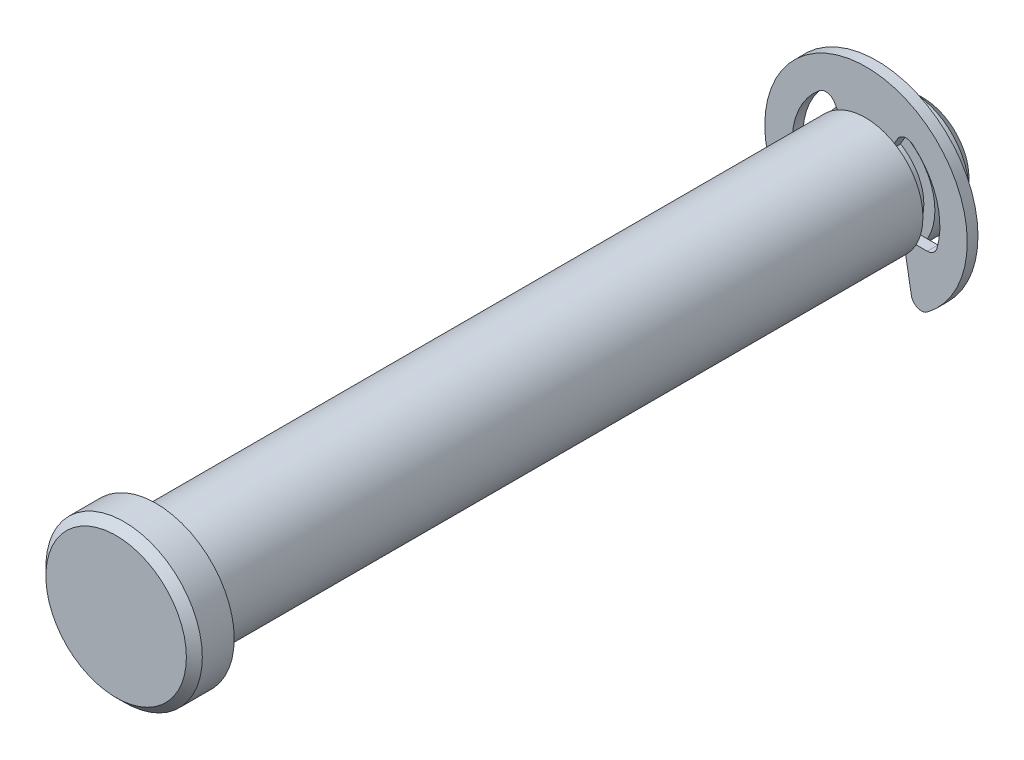
ISO-10303-21;
HEADER;
FILE_DESCRIPTION(('STEP AP214'),'2;1');
FILE_NAME('part.step','',(''),(''),'','','');
FILE_SCHEMA(('AUTOMOTIVE_DESIGN { 1 0 10303 214 1 1 1 1 }'));
ENDSEC;
DATA;
#1=APPLICATION_CONTEXT('core data for automotive mechanical design processes');
#2=APPLICATION_PROTOCOL_DEFINITION('international standard','automotive_design',2000,#1);
#3=PRODUCT_CONTEXT('',#1,'mechanical');
#4=PRODUCT('Part','Part','',(#3));
#5=PRODUCT_RELATED_PRODUCT_CATEGORY('part','',(#4));
#6=PRODUCT_DEFINITION_FORMATION('','',#4);
#7=PRODUCT_DEFINITION_CONTEXT('part definition',#1,'design');
#8=PRODUCT_DEFINITION('design','',#6,#7);
#9=PRODUCT_DEFINITION_SHAPE('','',#8);
#10=(LENGTH_UNIT() NAMED_UNIT(*) SI_UNIT(.MILLI.,.METRE.));
#11=(NAMED_UNIT(*) PLANE_ANGLE_UNIT() SI_UNIT($,.RADIAN.));
#12=(NAMED_UNIT(*) SI_UNIT($,.STERADIAN.) SOLID_ANGLE_UNIT());
#13=UNCERTAINTY_MEASURE_WITH_UNIT(LENGTH_MEASURE(1.E-05),#10,'distance_accuracy_value','');
#14=(GEOMETRIC_REPRESENTATION_CONTEXT(3) GLOBAL_UNCERTAINTY_ASSIGNED_CONTEXT((#13)) GLOBAL_UNIT_ASSIGNED_CONTEXT((#10,
#11,#12)) REPRESENTATION_CONTEXT('',''));
#15=CARTESIAN_POINT('',(0.,0.,0.));
#16=DIRECTION('',(0.,0.,1.));
#17=DIRECTION('',(1.,0.,0.));
#18=AXIS2_PLACEMENT_3D('',#15,#16,#17);
#19=CARTESIAN_POINT('',(0.,0.,-27.0383));
#20=DIRECTION('',(0.,0.,1.));
#21=DIRECTION('',(1.,0.,0.));
#22=AXIS2_PLACEMENT_3D('',#19,#20,#21);
#23=PLANE('',#22);
#24=DIRECTION('',(-0.173648177666931,0.984807753012208,0.));
#25=VECTOR('',#24,1.);
#26=CARTESIAN_POINT('',(2.59081415555905,0.45683043762648,-27.0383));
#27=LINE('',#26,#25);
#28=CARTESIAN_POINT('',(3.7540636467653,-6.14028525353106,-27.0383));
#29=VERTEX_POINT('',#28);
#30=CARTESIAN_POINT('',(3.07848,-2.30886,-27.0383));
#31=VERTEX_POINT('',#30);
#32=EDGE_CURVE('E250',#29,#31,#27,.T.);
#33=ORIENTED_EDGE('',*,*,#32,.F.);
#34=CARTESIAN_POINT('',(4.57952950534013,-5.99473335101063,-27.0383));
#35=DIRECTION('',(0.,0.,1.));
#36=DIRECTION('',(1.,0.,0.));
#37=AXIS2_PLACEMENT_3D('',#34,#35,#36);
#38=CIRCLE('',#37,0.8382);
#39=CARTESIAN_POINT('',(5.08836611704459,-6.66081483445626,-27.0383));
#40=VERTEX_POINT('',#39);
#41=EDGE_CURVE('E324',#29,#40,#38,.T.);
#42=ORIENTED_EDGE('',*,*,#41,.T.);
#43=CARTESIAN_POINT('',(0.,0.,-27.0383));
#44=DIRECTION('',(0.,0.,1.));
#45=DIRECTION('',(1.,0.,0.));
#46=AXIS2_PLACEMENT_3D('',#43,#44,#45);
#47=CIRCLE('',#46,8.382);
#48=CARTESIAN_POINT('',(-5.08836611704459,-6.66081483445626,-27.0383));
#49=VERTEX_POINT('',#48);
#50=EDGE_CURVE('E221',#40,#49,#47,.T.);
#51=ORIENTED_EDGE('',*,*,#50,.T.);
#52=CARTESIAN_POINT('',(-4.57952950534013,-5.99473335101063,-27.0383));
#53=DIRECTION('',(0.,0.,1.));
#54=DIRECTION('',(1.,0.,0.));
#55=AXIS2_PLACEMENT_3D('',#52,#53,#54);
#56=CIRCLE('',#55,0.8382);
#57=CARTESIAN_POINT('',(-3.7540636467653,-6.14028525353106,-27.0383));
#58=VERTEX_POINT('',#57);
#59=EDGE_CURVE('E321',#49,#58,#56,.T.);
#60=ORIENTED_EDGE('',*,*,#59,.T.);
#61=DIRECTION('',(-0.173648177666931,-0.984807753012208,0.));
#62=VECTOR('',#61,1.);
#63=CARTESIAN_POINT('',(-2.59081415555905,0.45683043762648,-27.0383));
#64=LINE('',#63,#62);
#65=CARTESIAN_POINT('',(-3.07848,-2.30886,-27.0383));
#66=VERTEX_POINT('',#65);
#67=EDGE_CURVE('E244',#66,#58,#64,.T.);
#68=ORIENTED_EDGE('',*,*,#67,.F.);
#69=DIRECTION('',(1.,0.,0.));
#70=VECTOR('',#69,1.);
#71=CARTESIAN_POINT('',(0.,-2.30886,-27.0383));
#72=LINE('',#71,#70);
#73=CARTESIAN_POINT('',(-5.06777121493266,-2.30886,-27.0383));
#74=VERTEX_POINT('',#73);
#75=EDGE_CURVE('E232',#74,#66,#72,.T.);
#76=ORIENTED_EDGE('',*,*,#75,.F.);
#77=CARTESIAN_POINT('',(-5.06777121493266,-1.47066,-27.0383));
#78=DIRECTION('',(0.,0.,1.));
#79=DIRECTION('',(1.,0.,0.));
#80=AXIS2_PLACEMENT_3D('',#77,#78,#79);
#81=CIRCLE('',#80,0.8382);
#82=CARTESIAN_POINT('',(-5.87276014438044,-1.70426664259928,-27.0383));
#83=VERTEX_POINT('',#82);
#84=EDGE_CURVE('E59',#74,#83,#81,.F.);
#85=ORIENTED_EDGE('',*,*,#84,.T.);
#86=CARTESIAN_POINT('',(0.,0.,-27.0383));
#87=DIRECTION('',(0.,0.,1.));
#88=DIRECTION('',(1.,0.,0.));
#89=AXIS2_PLACEMENT_3D('',#86,#87,#88);
#90=CIRCLE('',#89,6.11505);
#91=CARTESIAN_POINT('',(-3.85991365439078,4.74287919761273,-27.0383));
#92=VERTEX_POINT('',#91);
#93=EDGE_CURVE('E267',#92,#83,#90,.T.);
#94=ORIENTED_EDGE('',*,*,#93,.F.);
#95=CARTESIAN_POINT('',(-3.33082891671728,4.09276491507392,-27.0383));
#96=DIRECTION('',(0.,0.,1.));
#97=DIRECTION('',(1.,0.,0.));
#98=AXIS2_PLACEMENT_3D('',#95,#96,#97);
#99=CIRCLE('',#98,0.8382);
#100=CARTESIAN_POINT('',(-2.60492642326516,4.51186491507392,-27.0383));
#101=VERTEX_POINT('',#100);
#102=EDGE_CURVE('E225',#92,#101,#99,.F.);
#103=ORIENTED_EDGE('',*,*,#102,.T.);
#104=DIRECTION('',(-0.500000000000001,0.866025403784438,0.));
#105=VECTOR('',#104,1.);
#106=CARTESIAN_POINT('',(0.,0.,-27.0383));
#107=LINE('',#106,#105);
#108=CARTESIAN_POINT('',(-1.92405000000001,3.33255235630289,-27.0383));
#109=VERTEX_POINT('',#108);
#110=EDGE_CURVE('E216',#109,#101,#107,.T.);
#111=ORIENTED_EDGE('',*,*,#110,.F.);
#112=DIRECTION('',(1.,0.,0.));
#113=VECTOR('',#112,1.);
#114=CARTESIAN_POINT('',(-1.92405000000001,3.33255235630289,-27.0383));
#115=LINE('',#114,#113);
#116=CARTESIAN_POINT('',(1.92405000000001,3.33255235630289,-27.0383));
#117=VERTEX_POINT('',#116);
#118=EDGE_CURVE('E199',#109,#117,#115,.T.);
#119=ORIENTED_EDGE('',*,*,#118,.T.);
#120=DIRECTION('',(-0.500000000000001,-0.866025403784438,0.));
#121=VECTOR('',#120,1.);
#122=CARTESIAN_POINT('',(0.,0.,-27.0383));
#123=LINE('',#122,#121);
#124=CARTESIAN_POINT('',(2.60492642326516,4.51186491507392,-27.0383));
#125=VERTEX_POINT('',#124);
#126=EDGE_CURVE('E264',#125,#117,#123,.T.);
#127=ORIENTED_EDGE('',*,*,#126,.F.);
#128=CARTESIAN_POINT('',(3.33082891671728,4.09276491507392,-27.0383));
#129=DIRECTION('',(0.,0.,1.));
#130=DIRECTION('',(1.,0.,0.));
#131=AXIS2_PLACEMENT_3D('',#128,#129,#130);
#132=CIRCLE('',#131,0.8382);
#133=CARTESIAN_POINT('',(3.85991365439078,4.74287919761273,-27.0383));
#134=VERTEX_POINT('',#133);
#135=EDGE_CURVE('E347',#125,#134,#132,.F.);
#136=ORIENTED_EDGE('',*,*,#135,.T.);
#137=CARTESIAN_POINT('',(0.,0.,-27.0383));
#138=DIRECTION('',(0.,0.,1.));
#139=DIRECTION('',(1.,0.,0.));
#140=AXIS2_PLACEMENT_3D('',#137,#138,#139);
#141=CIRCLE('',#140,6.11505);
#142=CARTESIAN_POINT('',(5.87276014438044,-1.70426664259928,-27.0383));
#143=VERTEX_POINT('',#142);
#144=EDGE_CURVE('E271',#143,#134,#141,.T.);
#145=ORIENTED_EDGE('',*,*,#144,.F.);
#146=CARTESIAN_POINT('',(5.06777121493266,-1.47066,-27.0383));
#147=DIRECTION('',(0.,0.,1.));
#148=DIRECTION('',(1.,0.,0.));
#149=AXIS2_PLACEMENT_3D('',#146,#147,#148);
#150=CIRCLE('',#149,0.8382);
#151=CARTESIAN_POINT('',(5.06777121493266,-2.30886,-27.0383));
#152=VERTEX_POINT('',#151);
#153=EDGE_CURVE('E341',#143,#152,#150,.F.);
#154=ORIENTED_EDGE('',*,*,#153,.T.);
#155=DIRECTION('',(1.,0.,0.));
#156=VECTOR('',#155,1.);
#157=CARTESIAN_POINT('',(0.,-2.30886,-27.0383));
#158=LINE('',#157,#156);
#159=EDGE_CURVE('E257',#31,#152,#158,.T.);
#160=ORIENTED_EDGE('',*,*,#159,.F.);
#161=EDGE_LOOP('',(#33,#42,#51,#60,#68,#76,#85,#94,#103,#111,#119,#127,#136,#145,#154,#160));
#162=FACE_BOUND('',#161,.T.);
#163=ADVANCED_FACE('F50',(#162),#23,.T.);
#164=CARTESIAN_POINT('',(0.,0.,-27.9273));
#165=DIRECTION('',(0.,0.,1.));
#166=DIRECTION('',(1.,0.,0.));
#167=AXIS2_PLACEMENT_3D('',#164,#165,#166);
#168=PLANE('',#167);
#169=CARTESIAN_POINT('',(0.,0.,-27.9273));
#170=DIRECTION('',(0.,0.,1.));
#171=DIRECTION('',(1.,0.,0.));
#172=AXIS2_PLACEMENT_3D('',#169,#170,#171);
#173=CIRCLE('',#172,8.382);
#174=CARTESIAN_POINT('',(5.08836611704459,-6.66081483445626,-27.9273));
#175=VERTEX_POINT('',#174);
#176=CARTESIAN_POINT('',(-5.08836611704459,-6.66081483445626,-27.9273));
#177=VERTEX_POINT('',#176);
#178=EDGE_CURVE('E275',#175,#177,#173,.T.);
#179=ORIENTED_EDGE('',*,*,#178,.F.);
#180=CARTESIAN_POINT('',(4.57952950534013,-5.99473335101063,-27.9273));
#181=DIRECTION('',(0.,0.,1.));
#182=DIRECTION('',(1.,0.,0.));
#183=AXIS2_PLACEMENT_3D('',#180,#181,#182);
#184=CIRCLE('',#183,0.8382);
#185=CARTESIAN_POINT('',(3.7540636467653,-6.14028525353106,-27.9273));
#186=VERTEX_POINT('',#185);
#187=EDGE_CURVE('E336',#175,#186,#184,.F.);
#188=ORIENTED_EDGE('',*,*,#187,.T.);
#189=DIRECTION('',(-0.173648177666931,0.984807753012208,0.));
#190=VECTOR('',#189,1.);
#191=CARTESIAN_POINT('',(2.59081415555905,0.45683043762648,-27.9273));
#192=LINE('',#191,#190);
#193=CARTESIAN_POINT('',(3.07848,-2.30886,-27.9273));
#194=VERTEX_POINT('',#193);
#195=EDGE_CURVE('E247',#186,#194,#192,.T.);
#196=ORIENTED_EDGE('',*,*,#195,.T.);
#197=DIRECTION('',(1.,0.,0.));
#198=VECTOR('',#197,1.);
#199=CARTESIAN_POINT('',(0.,-2.30886,-27.9273));
#200=LINE('',#199,#198);
#201=CARTESIAN_POINT('',(5.06777121493266,-2.30886,-27.9273));
#202=VERTEX_POINT('',#201);
#203=EDGE_CURVE('E253',#194,#202,#200,.T.);
#204=ORIENTED_EDGE('',*,*,#203,.T.);
#205=CARTESIAN_POINT('',(5.06777121493266,-1.47066,-27.9273));
#206=DIRECTION('',(0.,0.,1.));
#207=DIRECTION('',(1.,0.,0.));
#208=AXIS2_PLACEMENT_3D('',#205,#206,#207);
#209=CIRCLE('',#208,0.8382);
#210=CARTESIAN_POINT('',(5.87276014438044,-1.70426664259928,-27.9273));
#211=VERTEX_POINT('',#210);
#212=EDGE_CURVE('E344',#202,#211,#209,.T.);
#213=ORIENTED_EDGE('',*,*,#212,.T.);
#214=CARTESIAN_POINT('',(0.,0.,-27.9273));
#215=DIRECTION('',(0.,0.,1.));
#216=DIRECTION('',(1.,0.,0.));
#217=AXIS2_PLACEMENT_3D('',#214,#215,#216);
#218=CIRCLE('',#217,6.11505);
#219=CARTESIAN_POINT('',(3.85991365439078,4.74287919761273,-27.9273));
#220=VERTEX_POINT('',#219);
#221=EDGE_CURVE('E287',#211,#220,#218,.T.);
#222=ORIENTED_EDGE('',*,*,#221,.T.);
#223=CARTESIAN_POINT('',(3.33082891671728,4.09276491507392,-27.9273));
#224=DIRECTION('',(0.,0.,1.));
#225=DIRECTION('',(1.,0.,0.));
#226=AXIS2_PLACEMENT_3D('',#223,#224,#225);
#227=CIRCLE('',#226,0.8382);
#228=CARTESIAN_POINT('',(2.60492642326516,4.51186491507392,-27.9273));
#229=VERTEX_POINT('',#228);
#230=EDGE_CURVE('E350',#220,#229,#227,.T.);
#231=ORIENTED_EDGE('',*,*,#230,.T.);
#232=DIRECTION('',(-0.500000000000001,-0.866025403784438,0.));
#233=VECTOR('',#232,1.);
#234=CARTESIAN_POINT('',(0.,0.,-27.9273));
#235=LINE('',#234,#233);
#236=CARTESIAN_POINT('',(1.92405000000001,3.3325523563029,-27.9273));
#237=VERTEX_POINT('',#236);
#238=EDGE_CURVE('E261',#229,#237,#235,.T.);
#239=ORIENTED_EDGE('',*,*,#238,.T.);
#240=DIRECTION('',(-1.,0.,0.));
#241=VECTOR('',#240,1.);
#242=CARTESIAN_POINT('',(-1.92405000000001,3.33255235630289,-27.9273));
#243=LINE('',#242,#241);
#244=CARTESIAN_POINT('',(-1.92405000000001,3.33255235630289,-27.9273));
#245=VERTEX_POINT('',#244);
#246=EDGE_CURVE('E211',#237,#245,#243,.T.);
#247=ORIENTED_EDGE('',*,*,#246,.T.);
#248=DIRECTION('',(-0.500000000000001,0.866025403784438,0.));
#249=VECTOR('',#248,1.);
#250=CARTESIAN_POINT('',(0.,0.,-27.9273));
#251=LINE('',#250,#249);
#252=CARTESIAN_POINT('',(-2.60492642326516,4.51186491507392,-27.9273));
#253=VERTEX_POINT('',#252);
#254=EDGE_CURVE('E219',#245,#253,#251,.T.);
#255=ORIENTED_EDGE('',*,*,#254,.T.);
#256=CARTESIAN_POINT('',(-3.33082891671728,4.09276491507392,-27.9273));
#257=DIRECTION('',(0.,0.,1.));
#258=DIRECTION('',(1.,0.,0.));
#259=AXIS2_PLACEMENT_3D('',#256,#257,#258);
#260=CIRCLE('',#259,0.8382);
#261=CARTESIAN_POINT('',(-3.85991365439078,4.74287919761273,-27.9273));
#262=VERTEX_POINT('',#261);
#263=EDGE_CURVE('E355',#253,#262,#260,.T.);
#264=ORIENTED_EDGE('',*,*,#263,.T.);
#265=CARTESIAN_POINT('',(0.,0.,-27.9273));
#266=DIRECTION('',(0.,0.,1.));
#267=DIRECTION('',(1.,0.,0.));
#268=AXIS2_PLACEMENT_3D('',#265,#266,#267);
#269=CIRCLE('',#268,6.11505);
#270=CARTESIAN_POINT('',(-5.87276014438044,-1.70426664259928,-27.9273));
#271=VERTEX_POINT('',#270);
#272=EDGE_CURVE('E283',#262,#271,#269,.T.);
#273=ORIENTED_EDGE('',*,*,#272,.T.);
#274=CARTESIAN_POINT('',(-5.06777121493266,-1.47066,-27.9273));
#275=DIRECTION('',(0.,0.,1.));
#276=DIRECTION('',(1.,0.,0.));
#277=AXIS2_PLACEMENT_3D('',#274,#275,#276);
#278=CIRCLE('',#277,0.8382);
#279=CARTESIAN_POINT('',(-5.06777121493266,-2.30886,-27.9273));
#280=VERTEX_POINT('',#279);
#281=EDGE_CURVE('E12',#271,#280,#278,.T.);
#282=ORIENTED_EDGE('',*,*,#281,.T.);
#283=DIRECTION('',(1.,0.,0.));
#284=VECTOR('',#283,1.);
#285=CARTESIAN_POINT('',(0.,-2.30886,-27.9273));
#286=LINE('',#285,#284);
#287=CARTESIAN_POINT('',(-3.07848,-2.30886,-27.9273));
#288=VERTEX_POINT('',#287);
#289=EDGE_CURVE('E227',#280,#288,#286,.T.);
#290=ORIENTED_EDGE('',*,*,#289,.T.);
#291=DIRECTION('',(-0.173648177666931,-0.984807753012208,0.));
#292=VECTOR('',#291,1.);
#293=CARTESIAN_POINT('',(-2.59081415555905,0.45683043762648,-27.9273));
#294=LINE('',#293,#292);
#295=CARTESIAN_POINT('',(-3.7540636467653,-6.14028525353106,-27.9273));
#296=VERTEX_POINT('',#295);
#297=EDGE_CURVE('E241',#288,#296,#294,.T.);
#298=ORIENTED_EDGE('',*,*,#297,.T.);
#299=CARTESIAN_POINT('',(-4.57952950534013,-5.99473335101063,-27.9273));
#300=DIRECTION('',(0.,0.,1.));
#301=DIRECTION('',(1.,0.,0.));
#302=AXIS2_PLACEMENT_3D('',#299,#300,#301);
#303=CIRCLE('',#302,0.8382);
#304=EDGE_CURVE('E78',#296,#177,#303,.F.);
#305=ORIENTED_EDGE('',*,*,#304,.T.);
#306=EDGE_LOOP('',(#179,#188,#196,#204,#213,#222,#231,#239,#247,#255,#264,#273,#282,#290,#298,#305));
#307=FACE_BOUND('',#306,.T.);
#308=ADVANCED_FACE('F370',(#307),#168,.F.);
#309=CARTESIAN_POINT('',(0.,0.,-27.0383));
#310=DIRECTION('',(0.,0.,-1.));
#311=DIRECTION('',(-1.,0.,0.));
#312=AXIS2_PLACEMENT_3D('',#309,#310,#311);
#313=CYLINDRICAL_SURFACE('',#312,8.382);
#314=ORIENTED_EDGE('',*,*,#50,.F.);
#315=DIRECTION('',(0.,0.,-1.));
#316=VECTOR('',#315,1.);
#317=CARTESIAN_POINT('',(5.08836611704459,-6.66081483445626,-27.0383));
#318=LINE('',#317,#316);
#319=EDGE_CURVE('E331',#40,#175,#318,.T.);
#320=ORIENTED_EDGE('',*,*,#319,.T.);
#321=ORIENTED_EDGE('',*,*,#178,.T.);
#322=DIRECTION('',(0.,0.,-1.));
#323=VECTOR('',#322,1.);
#324=CARTESIAN_POINT('',(-5.08836611704459,-6.66081483445626,-27.0383));
#325=LINE('',#324,#323);
#326=EDGE_CURVE('E327',#177,#49,#325,.F.);
#327=ORIENTED_EDGE('',*,*,#326,.T.);
#328=EDGE_LOOP('',(#314,#320,#321,#327));
#329=FACE_BOUND('',#328,.T.);
#330=ADVANCED_FACE('F413',(#329),#313,.T.);
#331=CARTESIAN_POINT('',(-3.07848,-2.30886,-31.75));
#332=DIRECTION('',(-0.984807753012208,0.173648177666931,0.));
#333=DIRECTION('',(-0.173648177666931,-0.984807753012208,0.));
#334=AXIS2_PLACEMENT_3D('',#331,#332,#333);
#335=PLANE('',#334);
#336=ORIENTED_EDGE('',*,*,#67,.T.);
#337=DIRECTION('',(0.,0.,-1.));
#338=VECTOR('',#337,1.);
#339=CARTESIAN_POINT('',(-3.7540636467653,-6.14028525353106,-31.75));
#340=LINE('',#339,#338);
#341=EDGE_CURVE('E69',#58,#296,#340,.T.);
#342=ORIENTED_EDGE('',*,*,#341,.T.);
#343=ORIENTED_EDGE('',*,*,#297,.F.);
#344=DIRECTION('',(0.,0.,1.));
#345=VECTOR('',#344,1.);
#346=CARTESIAN_POINT('',(-3.07848,-2.30886,-31.75));
#347=LINE('',#346,#345);
#348=EDGE_CURVE('E375',#288,#66,#347,.T.);
#349=ORIENTED_EDGE('',*,*,#348,.T.);
#350=EDGE_LOOP('',(#336,#342,#343,#349));
#351=FACE_BOUND('',#350,.T.);
#352=ADVANCED_FACE('F418',(#351),#335,.F.);
#353=CARTESIAN_POINT('',(-3.05752500000001,5.29578864541203,-31.75));
#354=DIRECTION('',(0.866025403784438,0.500000000000001,0.));
#355=DIRECTION('',(-0.500000000000001,0.866025403784438,0.));
#356=AXIS2_PLACEMENT_3D('',#353,#354,#355);
#357=PLANE('',#356);
#358=ORIENTED_EDGE('',*,*,#110,.T.);
#359=DIRECTION('',(0.,0.,-1.));
#360=VECTOR('',#359,1.);
#361=CARTESIAN_POINT('',(-2.60492642326516,4.51186491507392,-27.9273));
#362=LINE('',#361,#360);
#363=EDGE_CURVE('E310',#101,#253,#362,.T.);
#364=ORIENTED_EDGE('',*,*,#363,.T.);
#365=ORIENTED_EDGE('',*,*,#254,.F.);
#366=DIRECTION('',(0.,0.,-1.));
#367=VECTOR('',#366,1.);
#368=CARTESIAN_POINT('',(-1.92405000000001,3.3325523563029,-27.0383));
#369=LINE('',#368,#367);
#370=EDGE_CURVE('E203',#245,#109,#369,.F.);
#371=ORIENTED_EDGE('',*,*,#370,.T.);
#372=EDGE_LOOP('',(#358,#364,#365,#371));
#373=FACE_BOUND('',#372,.T.);
#374=ADVANCED_FACE('F215',(#373),#357,.F.);
#375=CARTESIAN_POINT('',(0.,0.,-31.75));
#376=DIRECTION('',(0.,0.,1.));
#377=DIRECTION('',(1.,0.,0.));
#378=AXIS2_PLACEMENT_3D('',#375,#376,#377);
#379=CYLINDRICAL_SURFACE('',#378,6.11505);
#380=ORIENTED_EDGE('',*,*,#272,.F.);
#381=DIRECTION('',(0.,0.,1.));
#382=VECTOR('',#381,1.);
#383=CARTESIAN_POINT('',(-3.85991365439078,4.74287919761273,-31.75));
#384=LINE('',#383,#382);
#385=EDGE_CURVE('E306',#262,#92,#384,.T.);
#386=ORIENTED_EDGE('',*,*,#385,.T.);
#387=ORIENTED_EDGE('',*,*,#93,.T.);
#388=DIRECTION('',(0.,0.,1.));
#389=VECTOR('',#388,1.);
#390=CARTESIAN_POINT('',(-5.87276014438044,-1.70426664259928,-31.75));
#391=LINE('',#390,#389);
#392=EDGE_CURVE('E303',#83,#271,#391,.F.);
#393=ORIENTED_EDGE('',*,*,#392,.T.);
#394=EDGE_LOOP('',(#380,#386,#387,#393));
#395=FACE_BOUND('',#394,.T.);
#396=ADVANCED_FACE('F365',(#395),#379,.F.);
#397=CARTESIAN_POINT('',(-5.66242015421851,-2.30886,-31.75));
#398=DIRECTION('',(0.,-1.,0.));
#399=DIRECTION('',(0.,0.,-1.));
#400=AXIS2_PLACEMENT_3D('',#397,#398,#399);
#401=PLANE('',#400);
#402=ORIENTED_EDGE('',*,*,#289,.F.);
#403=DIRECTION('',(0.,0.,-1.));
#404=VECTOR('',#403,1.);
#405=CARTESIAN_POINT('',(-5.06777121493266,-2.30886,-27.0383));
#406=LINE('',#405,#404);
#407=EDGE_CURVE('E313',#280,#74,#406,.F.);
#408=ORIENTED_EDGE('',*,*,#407,.T.);
#409=ORIENTED_EDGE('',*,*,#75,.T.);
#410=ORIENTED_EDGE('',*,*,#348,.F.);
#411=EDGE_LOOP('',(#402,#408,#409,#410));
#412=FACE_BOUND('',#411,.T.);
#413=ADVANCED_FACE('F373',(#412),#401,.F.);
#414=CARTESIAN_POINT('',(0.,0.,-31.75));
#415=DIRECTION('',(0.,0.,1.));
#416=DIRECTION('',(1.,0.,0.));
#417=AXIS2_PLACEMENT_3D('',#414,#415,#416);
#418=CYLINDRICAL_SURFACE('',#417,6.11505);
#419=ORIENTED_EDGE('',*,*,#221,.F.);
#420=DIRECTION('',(0.,0.,1.));
#421=VECTOR('',#420,1.);
#422=CARTESIAN_POINT('',(5.87276014438044,-1.70426664259928,-31.75));
#423=LINE('',#422,#421);
#424=EDGE_CURVE('E294',#211,#143,#423,.T.);
#425=ORIENTED_EDGE('',*,*,#424,.T.);
#426=ORIENTED_EDGE('',*,*,#144,.T.);
#427=DIRECTION('',(0.,0.,1.));
#428=VECTOR('',#427,1.);
#429=CARTESIAN_POINT('',(3.85991365439078,4.74287919761273,-31.75));
#430=LINE('',#429,#428);
#431=EDGE_CURVE('E291',#134,#220,#430,.F.);
#432=ORIENTED_EDGE('',*,*,#431,.T.);
#433=EDGE_LOOP('',(#419,#425,#426,#432));
#434=FACE_BOUND('',#433,.T.);
#435=ADVANCED_FACE('F392',(#434),#418,.F.);
#436=CARTESIAN_POINT('',(3.07848,-2.30886,-31.75));
#437=DIRECTION('',(0.,-1.,0.));
#438=DIRECTION('',(0.,0.,-1.));
#439=AXIS2_PLACEMENT_3D('',#436,#437,#438);
#440=PLANE('',#439);
#441=ORIENTED_EDGE('',*,*,#159,.T.);
#442=DIRECTION('',(0.,0.,-1.));
#443=VECTOR('',#442,1.);
#444=CARTESIAN_POINT('',(5.06777121493266,-2.30886,-27.9273));
#445=LINE('',#444,#443);
#446=EDGE_CURVE('E297',#152,#202,#445,.T.);
#447=ORIENTED_EDGE('',*,*,#446,.T.);
#448=ORIENTED_EDGE('',*,*,#203,.F.);
#449=DIRECTION('',(0.,0.,1.));
#450=VECTOR('',#449,1.);
#451=CARTESIAN_POINT('',(3.07848,-2.30886,-31.75));
#452=LINE('',#451,#450);
#453=EDGE_CURVE('E235',#194,#31,#452,.T.);
#454=ORIENTED_EDGE('',*,*,#453,.T.);
#455=EDGE_LOOP('',(#441,#447,#448,#454));
#456=FACE_BOUND('',#455,.T.);
#457=ADVANCED_FACE('F402',(#456),#440,.F.);
#458=CARTESIAN_POINT('',(3.07848,-2.30886,-31.75));
#459=DIRECTION('',(0.984807753012208,0.173648177666931,0.));
#460=DIRECTION('',(-0.173648177666931,0.984807753012208,0.));
#461=AXIS2_PLACEMENT_3D('',#458,#459,#460);
#462=PLANE('',#461);
#463=ORIENTED_EDGE('',*,*,#195,.F.);
#464=DIRECTION('',(0.,0.,-1.));
#465=VECTOR('',#464,1.);
#466=CARTESIAN_POINT('',(3.7540636467653,-6.14028525353106,-31.75));
#467=LINE('',#466,#465);
#468=EDGE_CURVE('E317',#186,#29,#467,.F.);
#469=ORIENTED_EDGE('',*,*,#468,.T.);
#470=ORIENTED_EDGE('',*,*,#32,.T.);
#471=ORIENTED_EDGE('',*,*,#453,.F.);
#472=EDGE_LOOP('',(#463,#469,#470,#471));
#473=FACE_BOUND('',#472,.T.);
#474=ADVANCED_FACE('F407',(#473),#462,.F.);
#475=CARTESIAN_POINT('',(0.,0.,-31.75));
#476=DIRECTION('',(-0.866025403784438,0.500000000000001,0.));
#477=DIRECTION('',(-0.500000000000001,-0.866025403784438,0.));
#478=AXIS2_PLACEMENT_3D('',#475,#476,#477);
#479=PLANE('',#478);
#480=ORIENTED_EDGE('',*,*,#238,.F.);
#481=DIRECTION('',(0.,0.,-1.));
#482=VECTOR('',#481,1.);
#483=CARTESIAN_POINT('',(2.60492642326516,4.51186491507392,-27.0383));
#484=LINE('',#483,#482);
#485=EDGE_CURVE('E299',#229,#125,#484,.F.);
#486=ORIENTED_EDGE('',*,*,#485,.T.);
#487=ORIENTED_EDGE('',*,*,#126,.T.);
#488=DIRECTION('',(0.,0.,-1.));
#489=VECTOR('',#488,1.);
#490=CARTESIAN_POINT('',(1.92405000000001,3.3325523563029,-27.0383));
#491=LINE('',#490,#489);
#492=EDGE_CURVE('E206',#117,#237,#491,.T.);
#493=ORIENTED_EDGE('',*,*,#492,.T.);
#494=EDGE_LOOP('',(#480,#486,#487,#493));
#495=FACE_BOUND('',#494,.T.);
#496=ADVANCED_FACE('F385',(#495),#479,.F.);
#497=CARTESIAN_POINT('',(-1.92405000000001,3.33255235630289,-31.8097815495919));
#498=DIRECTION('',(0.,-1.,0.));
#499=DIRECTION('',(0.,0.,-1.));
#500=AXIS2_PLACEMENT_3D('',#497,#498,#499);
#501=PLANE('',#500);
#502=ORIENTED_EDGE('',*,*,#246,.F.);
#503=ORIENTED_EDGE('',*,*,#492,.F.);
#504=ORIENTED_EDGE('',*,*,#118,.F.);
#505=ORIENTED_EDGE('',*,*,#370,.F.);
#506=EDGE_LOOP('',(#502,#503,#504,#505));
#507=FACE_BOUND('',#506,.T.);
#508=ADVANCED_FACE('F202',(#507),#501,.T.);
#509=CARTESIAN_POINT('',(5.06777121493266,-1.47066,-31.75));
#510=DIRECTION('',(0.,0.,1.));
#511=DIRECTION('',(1.,0.,0.));
#512=AXIS2_PLACEMENT_3D('',#509,#510,#511);
#513=CYLINDRICAL_SURFACE('',#512,0.8382);
#514=ORIENTED_EDGE('',*,*,#212,.F.);
#515=ORIENTED_EDGE('',*,*,#446,.F.);
#516=ORIENTED_EDGE('',*,*,#153,.F.);
#517=ORIENTED_EDGE('',*,*,#424,.F.);
#518=EDGE_LOOP('',(#514,#515,#516,#517));
#519=FACE_BOUND('',#518,.T.);
#520=ADVANCED_FACE('F398',(#519),#513,.F.);
#521=CARTESIAN_POINT('',(3.33082891671728,4.09276491507392,-31.75));
#522=DIRECTION('',(0.,0.,1.));
#523=DIRECTION('',(1.,0.,0.));
#524=AXIS2_PLACEMENT_3D('',#521,#522,#523);
#525=CYLINDRICAL_SURFACE('',#524,0.8382);
#526=ORIENTED_EDGE('',*,*,#230,.F.);
#527=ORIENTED_EDGE('',*,*,#431,.F.);
#528=ORIENTED_EDGE('',*,*,#135,.F.);
#529=ORIENTED_EDGE('',*,*,#485,.F.);
#530=EDGE_LOOP('',(#526,#527,#528,#529));
#531=FACE_BOUND('',#530,.T.);
#532=ADVANCED_FACE('F395',(#531),#525,.F.);
#533=CARTESIAN_POINT('',(-3.33082891671728,4.09276491507392,-31.75));
#534=DIRECTION('',(0.,0.,1.));
#535=DIRECTION('',(1.,0.,0.));
#536=AXIS2_PLACEMENT_3D('',#533,#534,#535);
#537=CYLINDRICAL_SURFACE('',#536,0.8382);
#538=ORIENTED_EDGE('',*,*,#263,.F.);
#539=ORIENTED_EDGE('',*,*,#363,.F.);
#540=ORIENTED_EDGE('',*,*,#102,.F.);
#541=ORIENTED_EDGE('',*,*,#385,.F.);
#542=EDGE_LOOP('',(#538,#539,#540,#541));
#543=FACE_BOUND('',#542,.T.);
#544=ADVANCED_FACE('F441',(#543),#537,.F.);
#545=CARTESIAN_POINT('',(-5.06777121493266,-1.47066,-31.75));
#546=DIRECTION('',(0.,0.,1.));
#547=DIRECTION('',(1.,0.,0.));
#548=AXIS2_PLACEMENT_3D('',#545,#546,#547);
#549=CYLINDRICAL_SURFACE('',#548,0.8382);
#550=ORIENTED_EDGE('',*,*,#281,.F.);
#551=ORIENTED_EDGE('',*,*,#392,.F.);
#552=ORIENTED_EDGE('',*,*,#84,.F.);
#553=ORIENTED_EDGE('',*,*,#407,.F.);
#554=EDGE_LOOP('',(#550,#551,#552,#553));
#555=FACE_BOUND('',#554,.T.);
#556=ADVANCED_FACE('F368',(#555),#549,.F.);
#557=CARTESIAN_POINT('',(4.57952950534013,-5.99473335101063,-27.0383));
#558=DIRECTION('',(0.,0.,-1.));
#559=DIRECTION('',(-1.,0.,0.));
#560=AXIS2_PLACEMENT_3D('',#557,#558,#559);
#561=CYLINDRICAL_SURFACE('',#560,0.8382);
#562=ORIENTED_EDGE('',*,*,#187,.F.);
#563=ORIENTED_EDGE('',*,*,#319,.F.);
#564=ORIENTED_EDGE('',*,*,#41,.F.);
#565=ORIENTED_EDGE('',*,*,#468,.F.);
#566=EDGE_LOOP('',(#562,#563,#564,#565));
#567=FACE_BOUND('',#566,.T.);
#568=ADVANCED_FACE('F416',(#567),#561,.T.);
#569=CARTESIAN_POINT('',(-4.57952950534013,-5.99473335101063,-27.0383));
#570=DIRECTION('',(0.,0.,-1.));
#571=DIRECTION('',(-1.,0.,0.));
#572=AXIS2_PLACEMENT_3D('',#569,#570,#571);
#573=CYLINDRICAL_SURFACE('',#572,0.8382);
#574=ORIENTED_EDGE('',*,*,#304,.F.);
#575=ORIENTED_EDGE('',*,*,#341,.F.);
#576=ORIENTED_EDGE('',*,*,#59,.F.);
#577=ORIENTED_EDGE('',*,*,#326,.F.);
#578=EDGE_LOOP('',(#574,#575,#576,#577));
#579=FACE_BOUND('',#578,.T.);
#580=ADVANCED_FACE('F52',(#579),#573,.T.);
#581=CLOSED_SHELL('',(#163,#308,#330,#352,#374,#396,#413,#435,#457,#474,#496,#508,#520,#532,
#544,#556,#568,#580));
#582=MANIFOLD_SOLID_BREP('B2',#581);
#583=CARTESIAN_POINT('',(0.,0.,31.75));
#584=DIRECTION('',(0.,0.,-1.));
#585=DIRECTION('',(-1.,0.,0.));
#586=AXIS2_PLACEMENT_3D('',#583,#584,#585);
#587=CYLINDRICAL_SURFACE('',#586,4.7625);
#588=CARTESIAN_POINT('',(0.,0.,31.75));
#589=DIRECTION('',(0.,0.,1.));
#590=DIRECTION('',(1.,0.,0.));
#591=AXIS2_PLACEMENT_3D('',#588,#589,#590);
#592=CIRCLE('',#591,4.7625);
#593=CARTESIAN_POINT('',(4.7625,0.,31.75));
#594=VERTEX_POINT('',#593);
#595=EDGE_CURVE('E597',#594,#594,#592,.T.);
#596=ORIENTED_EDGE('',*,*,#595,.F.);
#597=EDGE_LOOP('',(#596));
#598=FACE_BOUND('',#597,.T.);
#599=CARTESIAN_POINT('',(0.,0.,-26.9875));
#600=DIRECTION('',(0.,0.,1.));
#601=DIRECTION('',(1.,0.,0.));
#602=AXIS2_PLACEMENT_3D('',#599,#600,#601);
#603=CIRCLE('',#602,4.7625);
#604=CARTESIAN_POINT('',(4.7625,0.,-26.9875));
#605=VERTEX_POINT('',#604);
#606=EDGE_CURVE('E611',#605,#605,#603,.T.);
#607=ORIENTED_EDGE('',*,*,#606,.T.);
#608=EDGE_LOOP('',(#607));
#609=FACE_BOUND('',#608,.T.);
#610=ADVANCED_FACE('F571',(#598,#609),#587,.T.);
#611=CARTESIAN_POINT('',(0.,4.7625,-26.9875));
#612=DIRECTION('',(0.,0.,-1.));
#613=DIRECTION('',(-1.,0.,0.));
#614=AXIS2_PLACEMENT_3D('',#611,#612,#613);
#615=PLANE('',#614);
#616=CARTESIAN_POINT('',(0.,0.,-26.9875));
#617=DIRECTION('',(0.,0.,1.));
#618=DIRECTION('',(1.,0.,0.));
#619=AXIS2_PLACEMENT_3D('',#616,#617,#618);
#620=CIRCLE('',#619,3.8481);
#621=CARTESIAN_POINT('',(3.8481,0.,-26.9875));
#622=VERTEX_POINT('',#621);
#623=EDGE_CURVE('E600',#622,#622,#620,.T.);
#624=ORIENTED_EDGE('',*,*,#623,.T.);
#625=EDGE_LOOP('',(#624));
#626=FACE_BOUND('',#625,.T.);
#627=ORIENTED_EDGE('',*,*,#606,.F.);
#628=EDGE_LOOP('',(#627));
#629=FACE_BOUND('',#628,.T.);
#630=ADVANCED_FACE('F631',(#626,#629),#615,.T.);
#631=CARTESIAN_POINT('',(0.,0.,31.75));
#632=DIRECTION('',(0.,0.,1.));
#633=DIRECTION('',(1.,0.,0.));
#634=AXIS2_PLACEMENT_3D('',#631,#632,#633);
#635=CYLINDRICAL_SURFACE('',#634,3.8481);
#636=CARTESIAN_POINT('',(0.,0.,-27.9781));
#637=DIRECTION('',(0.,0.,1.));
#638=DIRECTION('',(1.,0.,0.));
#639=AXIS2_PLACEMENT_3D('',#636,#637,#638);
#640=CIRCLE('',#639,3.8481);
#641=CARTESIAN_POINT('',(3.8481,0.,-27.9781));
#642=VERTEX_POINT('',#641);
#643=EDGE_CURVE('E603',#642,#642,#640,.T.);
#644=ORIENTED_EDGE('',*,*,#643,.T.);
#645=EDGE_LOOP('',(#644));
#646=FACE_BOUND('',#645,.T.);
#647=ORIENTED_EDGE('',*,*,#623,.F.);
#648=EDGE_LOOP('',(#647));
#649=FACE_BOUND('',#648,.T.);
#650=ADVANCED_FACE('F636',(#646,#649),#635,.T.);
#651=CARTESIAN_POINT('',(0.,4.7625,-27.9781));
#652=DIRECTION('',(0.,0.,1.));
#653=DIRECTION('',(1.,0.,0.));
#654=AXIS2_PLACEMENT_3D('',#651,#652,#653);
#655=PLANE('',#654);
#656=CARTESIAN_POINT('',(0.,0.,-27.9781));
#657=DIRECTION('',(0.,0.,1.));
#658=DIRECTION('',(1.,0.,0.));
#659=AXIS2_PLACEMENT_3D('',#656,#657,#658);
#660=CIRCLE('',#659,4.7625);
#661=CARTESIAN_POINT('',(4.7625,0.,-27.9781));
#662=VERTEX_POINT('',#661);
#663=EDGE_CURVE('E607',#662,#662,#660,.T.);
#664=ORIENTED_EDGE('',*,*,#663,.T.);
#665=EDGE_LOOP('',(#664));
#666=FACE_BOUND('',#665,.T.);
#667=ORIENTED_EDGE('',*,*,#643,.F.);
#668=EDGE_LOOP('',(#667));
#669=FACE_BOUND('',#668,.T.);
#670=ADVANCED_FACE('F642',(#666,#669),#655,.T.);
#671=CARTESIAN_POINT('',(0.,0.,-31.75));
#672=DIRECTION('',(0.,0.,1.));
#673=DIRECTION('',(1.,0.,0.));
#674=AXIS2_PLACEMENT_3D('',#671,#672,#673);
#675=PLANE('',#674);
#676=CARTESIAN_POINT('',(0.,0.,-31.75));
#677=DIRECTION('',(0.,0.,1.));
#678=DIRECTION('',(1.,0.,0.));
#679=AXIS2_PLACEMENT_3D('',#676,#677,#678);
#680=CIRCLE('',#679,3.81);
#681=CARTESIAN_POINT('',(3.81,0.,-31.75));
#682=VERTEX_POINT('',#681);
#683=EDGE_CURVE('E49',#682,#682,#680,.F.);
#684=ORIENTED_EDGE('',*,*,#683,.T.);
#685=EDGE_LOOP('',(#684));
#686=FACE_BOUND('',#685,.T.);
#687=ADVANCED_FACE('F647',(#686),#675,.F.);
#688=CARTESIAN_POINT('',(0.,0.,-30.7975));
#689=DIRECTION('',(0.,0.,1.));
#690=DIRECTION('',(1.,0.,0.));
#691=AXIS2_PLACEMENT_3D('',#688,#689,#690);
#692=CIRCLE('',#691,4.7625);
#693=CARTESIAN_POINT('',(4.7625,0.,-30.7975));
#694=VERTEX_POINT('',#693);
#695=EDGE_CURVE('E579',#694,#694,#692,.T.);
#696=ORIENTED_EDGE('',*,*,#695,.T.);
#697=EDGE_LOOP('',(#696));
#698=FACE_BOUND('',#697,.T.);
#699=ORIENTED_EDGE('',*,*,#663,.F.);
#700=EDGE_LOOP('',(#699));
#701=FACE_BOUND('',#700,.T.);
#702=ADVANCED_FACE('F625',(#698,#701),#587,.T.);
#703=CARTESIAN_POINT('',(0.,0.,31.75));
#704=DIRECTION('',(0.,0.,1.));
#705=DIRECTION('',(1.,0.,0.));
#706=AXIS2_PLACEMENT_3D('',#703,#704,#705);
#707=PLANE('',#706);
#708=CARTESIAN_POINT('',(0.,0.,31.75));
#709=DIRECTION('',(0.,0.,1.));
#710=DIRECTION('',(1.,0.,0.));
#711=AXIS2_PLACEMENT_3D('',#708,#709,#710);
#712=CIRCLE('',#711,6.477);
#713=CARTESIAN_POINT('',(6.477,0.,31.75));
#714=VERTEX_POINT('',#713);
#715=EDGE_CURVE('E615',#714,#714,#712,.T.);
#716=ORIENTED_EDGE('',*,*,#715,.F.);
#717=EDGE_LOOP('',(#716));
#718=FACE_BOUND('',#717,.T.);
#719=ORIENTED_EDGE('',*,*,#595,.T.);
#720=EDGE_LOOP('',(#719));
#721=FACE_BOUND('',#720,.T.);
#722=ADVANCED_FACE('F622',(#718,#721),#707,.F.);
#723=CARTESIAN_POINT('',(0.,0.,35.052));
#724=DIRECTION('',(0.,0.,-1.));
#725=DIRECTION('',(-1.,0.,0.));
#726=AXIS2_PLACEMENT_3D('',#723,#724,#725);
#727=CYLINDRICAL_SURFACE('',#726,6.477);
#728=CARTESIAN_POINT('',(0.,0.,34.3916));
#729=DIRECTION('',(0.,0.,1.));
#730=DIRECTION('',(1.,0.,0.));
#731=AXIS2_PLACEMENT_3D('',#728,#729,#730);
#732=CIRCLE('',#731,6.477);
#733=CARTESIAN_POINT('',(6.477,0.,34.3916));
#734=VERTEX_POINT('',#733);
#735=EDGE_CURVE('E585',#734,#734,#732,.F.);
#736=ORIENTED_EDGE('',*,*,#735,.T.);
#737=EDGE_LOOP('',(#736));
#738=FACE_BOUND('',#737,.T.);
#739=ORIENTED_EDGE('',*,*,#715,.T.);
#740=EDGE_LOOP('',(#739));
#741=FACE_BOUND('',#740,.T.);
#742=ADVANCED_FACE('F620',(#738,#741),#727,.T.);
#743=CARTESIAN_POINT('',(0.,0.,35.052));
#744=DIRECTION('',(0.,0.,1.));
#745=DIRECTION('',(1.,0.,0.));
#746=AXIS2_PLACEMENT_3D('',#743,#744,#745);
#747=PLANE('',#746);
#748=CARTESIAN_POINT('',(0.,0.,35.052));
#749=DIRECTION('',(0.,0.,1.));
#750=DIRECTION('',(1.,0.,0.));
#751=AXIS2_PLACEMENT_3D('',#748,#749,#750);
#752=CIRCLE('',#751,5.81660000000003);
#753=CARTESIAN_POINT('',(5.81660000000003,0.,35.052));
#754=VERTEX_POINT('',#753);
#755=EDGE_CURVE('E591',#754,#754,#752,.T.);
#756=ORIENTED_EDGE('',*,*,#755,.T.);
#757=EDGE_LOOP('',(#756));
#758=FACE_BOUND('',#757,.T.);
#759=ADVANCED_FACE('F651',(#758),#747,.T.);
#760=CARTESIAN_POINT('',(0.,0.,35.052));
#761=DIRECTION('',(0.,0.,-1.));
#762=DIRECTION('',(-1.,0.,0.));
#763=AXIS2_PLACEMENT_3D('',#760,#761,#762);
#764=CONICAL_SURFACE('',#763,5.81660000000003,0.785398163397441);
#765=ORIENTED_EDGE('',*,*,#735,.F.);
#766=EDGE_LOOP('',(#765));
#767=FACE_BOUND('',#766,.T.);
#768=ORIENTED_EDGE('',*,*,#755,.F.);
#769=EDGE_LOOP('',(#768));
#770=FACE_BOUND('',#769,.T.);
#771=ADVANCED_FACE('F649',(#767,#770),#764,.T.);
#772=CARTESIAN_POINT('',(0.,0.,-30.7975));
#773=DIRECTION('',(0.,0.,1.));
#774=DIRECTION('',(1.,0.,0.));
#775=AXIS2_PLACEMENT_3D('',#772,#773,#774);
#776=CONICAL_SURFACE('',#775,4.7625,0.785398163397451);
#777=ORIENTED_EDGE('',*,*,#683,.F.);
#778=EDGE_LOOP('',(#777));
#779=FACE_BOUND('',#778,.T.);
#780=ORIENTED_EDGE('',*,*,#695,.F.);
#781=EDGE_LOOP('',(#780));
#782=FACE_BOUND('',#781,.T.);
#783=ADVANCED_FACE('F573',(#779,#782),#776,.T.);
#784=CLOSED_SHELL('',(#610,#630,#650,#670,#687,#702,#722,#742,#759,#771,#783));
#785=MANIFOLD_SOLID_BREP('B6',#784);
#786=ADVANCED_BREP_SHAPE_REPRESENTATION('',(#18,#582,#785),#14);
#787=SHAPE_DEFINITION_REPRESENTATION(#9,#786);
ENDSEC;
END-ISO-10303-21;
